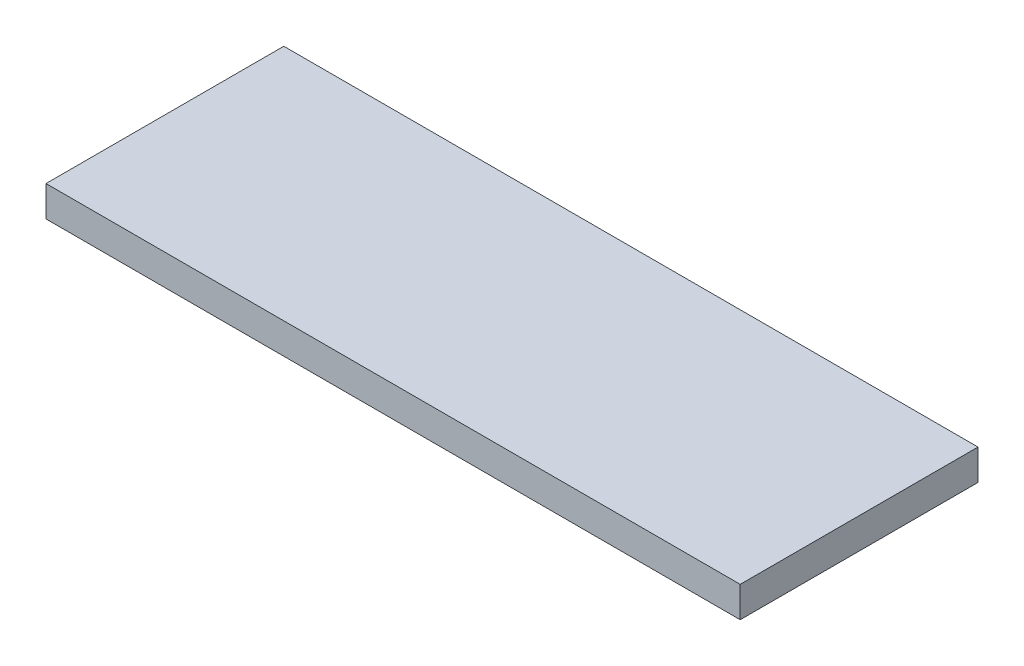
ISO-10303-21;
HEADER;
FILE_DESCRIPTION(('STEP AP214'),'2;1');
FILE_NAME('part.step','',(''),(''),'','','');
FILE_SCHEMA(('AUTOMOTIVE_DESIGN { 1 0 10303 214 1 1 1 1 }'));
ENDSEC;
DATA;
#1=APPLICATION_CONTEXT('core data for automotive mechanical design processes');
#2=APPLICATION_PROTOCOL_DEFINITION('international standard','automotive_design',2000,#1);
#3=PRODUCT_CONTEXT('',#1,'mechanical');
#4=PRODUCT('Part','Part','',(#3));
#5=PRODUCT_RELATED_PRODUCT_CATEGORY('part','',(#4));
#6=PRODUCT_DEFINITION_FORMATION('','',#4);
#7=PRODUCT_DEFINITION_CONTEXT('part definition',#1,'design');
#8=PRODUCT_DEFINITION('design','',#6,#7);
#9=PRODUCT_DEFINITION_SHAPE('','',#8);
#10=(LENGTH_UNIT() NAMED_UNIT(*) SI_UNIT(.MILLI.,.METRE.));
#11=(NAMED_UNIT(*) PLANE_ANGLE_UNIT() SI_UNIT($,.RADIAN.));
#12=(NAMED_UNIT(*) SI_UNIT($,.STERADIAN.) SOLID_ANGLE_UNIT());
#13=UNCERTAINTY_MEASURE_WITH_UNIT(LENGTH_MEASURE(1.E-05),#10,'distance_accuracy_value','');
#14=(GEOMETRIC_REPRESENTATION_CONTEXT(3) GLOBAL_UNCERTAINTY_ASSIGNED_CONTEXT((#13)) GLOBAL_UNIT_ASSIGNED_CONTEXT((#10,
#11,#12)) REPRESENTATION_CONTEXT('',''));
#15=CARTESIAN_POINT('',(0.,0.,0.));
#16=DIRECTION('',(0.,0.,1.));
#17=DIRECTION('',(1.,0.,0.));
#18=AXIS2_PLACEMENT_3D('',#15,#16,#17);
#19=CARTESIAN_POINT('',(0.,8.00000000000001,0.));
#20=DIRECTION('',(0.,1.,0.));
#21=DIRECTION('',(0.,0.,1.));
#22=AXIS2_PLACEMENT_3D('',#19,#20,#21);
#23=PLANE('',#22);
#24=DIRECTION('',(-1.,0.,0.));
#25=VECTOR('',#24,1.);
#26=CARTESIAN_POINT('',(90.5,8.00000000000001,-31.));
#27=LINE('',#26,#25);
#28=CARTESIAN_POINT('',(-90.5,8.00000000000001,-31.));
#29=VERTEX_POINT('',#28);
#30=CARTESIAN_POINT('',(90.5,8.00000000000001,-31.));
#31=VERTEX_POINT('',#30);
#32=EDGE_CURVE('E67',#29,#31,#27,.F.);
#33=ORIENTED_EDGE('',*,*,#32,.F.);
#34=DIRECTION('',(0.,0.,1.));
#35=VECTOR('',#34,1.);
#36=CARTESIAN_POINT('',(-90.5,8.00000000000001,-31.));
#37=LINE('',#36,#35);
#38=CARTESIAN_POINT('',(-90.5,8.00000000000001,31.));
#39=VERTEX_POINT('',#38);
#40=EDGE_CURVE('E19',#39,#29,#37,.F.);
#41=ORIENTED_EDGE('',*,*,#40,.F.);
#42=DIRECTION('',(1.,0.,0.));
#43=VECTOR('',#42,1.);
#44=CARTESIAN_POINT('',(-90.5,8.00000000000001,31.));
#45=LINE('',#44,#43);
#46=CARTESIAN_POINT('',(90.5,8.00000000000001,31.));
#47=VERTEX_POINT('',#46);
#48=EDGE_CURVE('E57',#47,#39,#45,.F.);
#49=ORIENTED_EDGE('',*,*,#48,.F.);
#50=DIRECTION('',(0.,0.,-1.));
#51=VECTOR('',#50,1.);
#52=CARTESIAN_POINT('',(90.5,8.00000000000001,31.));
#53=LINE('',#52,#51);
#54=EDGE_CURVE('E52',#31,#47,#53,.F.);
#55=ORIENTED_EDGE('',*,*,#54,.F.);
#56=EDGE_LOOP('',(#33,#41,#49,#55));
#57=FACE_BOUND('',#56,.T.);
#58=ADVANCED_FACE('F16',(#57),#23,.T.);
#59=CARTESIAN_POINT('',(-90.5,0.,-31.));
#60=DIRECTION('',(-1.,0.,0.));
#61=DIRECTION('',(0.,0.,1.));
#62=AXIS2_PLACEMENT_3D('',#59,#60,#61);
#63=PLANE('',#62);
#64=DIRECTION('',(0.,1.,0.));
#65=VECTOR('',#64,1.);
#66=CARTESIAN_POINT('',(-90.5,0.,-31.));
#67=LINE('',#66,#65);
#68=CARTESIAN_POINT('',(-90.5,0.,-31.));
#69=VERTEX_POINT('',#68);
#70=EDGE_CURVE('E78',#69,#29,#67,.T.);
#71=ORIENTED_EDGE('',*,*,#70,.F.);
#72=DIRECTION('',(0.,0.,1.));
#73=VECTOR('',#72,1.);
#74=CARTESIAN_POINT('',(-90.5,0.,0.));
#75=LINE('',#74,#73);
#76=CARTESIAN_POINT('',(-90.5,0.,31.));
#77=VERTEX_POINT('',#76);
#78=EDGE_CURVE('E73',#69,#77,#75,.T.);
#79=ORIENTED_EDGE('',*,*,#78,.T.);
#80=DIRECTION('',(0.,1.,0.));
#81=VECTOR('',#80,1.);
#82=CARTESIAN_POINT('',(-90.5,0.,31.));
#83=LINE('',#82,#81);
#84=EDGE_CURVE('E62',#39,#77,#83,.F.);
#85=ORIENTED_EDGE('',*,*,#84,.F.);
#86=ORIENTED_EDGE('',*,*,#40,.T.);
#87=EDGE_LOOP('',(#71,#79,#85,#86));
#88=FACE_BOUND('',#87,.T.);
#89=ADVANCED_FACE('F72',(#88),#63,.T.);
#90=CARTESIAN_POINT('',(-90.5,0.,31.));
#91=DIRECTION('',(0.,0.,1.));
#92=DIRECTION('',(1.,0.,0.));
#93=AXIS2_PLACEMENT_3D('',#90,#91,#92);
#94=PLANE('',#93);
#95=ORIENTED_EDGE('',*,*,#84,.T.);
#96=DIRECTION('',(1.,0.,0.));
#97=VECTOR('',#96,1.);
#98=CARTESIAN_POINT('',(0.,0.,31.));
#99=LINE('',#98,#97);
#100=CARTESIAN_POINT('',(90.5,0.,31.));
#101=VERTEX_POINT('',#100);
#102=EDGE_CURVE('E83',#77,#101,#99,.T.);
#103=ORIENTED_EDGE('',*,*,#102,.T.);
#104=DIRECTION('',(0.,1.,0.));
#105=VECTOR('',#104,1.);
#106=CARTESIAN_POINT('',(90.5,0.,31.));
#107=LINE('',#106,#105);
#108=EDGE_CURVE('E64',#47,#101,#107,.F.);
#109=ORIENTED_EDGE('',*,*,#108,.F.);
#110=ORIENTED_EDGE('',*,*,#48,.T.);
#111=EDGE_LOOP('',(#95,#103,#109,#110));
#112=FACE_BOUND('',#111,.T.);
#113=ADVANCED_FACE('F59',(#112),#94,.T.);
#114=CARTESIAN_POINT('',(90.5,0.,31.));
#115=DIRECTION('',(1.,0.,0.));
#116=DIRECTION('',(0.,0.,-1.));
#117=AXIS2_PLACEMENT_3D('',#114,#115,#116);
#118=PLANE('',#117);
#119=ORIENTED_EDGE('',*,*,#108,.T.);
#120=DIRECTION('',(0.,0.,1.));
#121=VECTOR('',#120,1.);
#122=CARTESIAN_POINT('',(90.5,0.,0.));
#123=LINE('',#122,#121);
#124=CARTESIAN_POINT('',(90.5,0.,-31.));
#125=VERTEX_POINT('',#124);
#126=EDGE_CURVE('E25',#101,#125,#123,.F.);
#127=ORIENTED_EDGE('',*,*,#126,.T.);
#128=DIRECTION('',(0.,1.,0.));
#129=VECTOR('',#128,1.);
#130=CARTESIAN_POINT('',(90.5,0.,-31.));
#131=LINE('',#130,#129);
#132=EDGE_CURVE('E33',#31,#125,#131,.F.);
#133=ORIENTED_EDGE('',*,*,#132,.F.);
#134=ORIENTED_EDGE('',*,*,#54,.T.);
#135=EDGE_LOOP('',(#119,#127,#133,#134));
#136=FACE_BOUND('',#135,.T.);
#137=ADVANCED_FACE('F87',(#136),#118,.T.);
#138=CARTESIAN_POINT('',(90.5,0.,-31.));
#139=DIRECTION('',(0.,0.,-1.));
#140=DIRECTION('',(-1.,0.,0.));
#141=AXIS2_PLACEMENT_3D('',#138,#139,#140);
#142=PLANE('',#141);
#143=ORIENTED_EDGE('',*,*,#132,.T.);
#144=DIRECTION('',(1.,0.,0.));
#145=VECTOR('',#144,1.);
#146=CARTESIAN_POINT('',(0.,0.,-31.));
#147=LINE('',#146,#145);
#148=EDGE_CURVE('E11',#125,#69,#147,.F.);
#149=ORIENTED_EDGE('',*,*,#148,.T.);
#150=ORIENTED_EDGE('',*,*,#70,.T.);
#151=ORIENTED_EDGE('',*,*,#32,.T.);
#152=EDGE_LOOP('',(#143,#149,#150,#151));
#153=FACE_BOUND('',#152,.T.);
#154=ADVANCED_FACE('F90',(#153),#142,.T.);
#155=CARTESIAN_POINT('',(0.,0.,0.));
#156=DIRECTION('',(0.,1.,0.));
#157=DIRECTION('',(0.,0.,1.));
#158=AXIS2_PLACEMENT_3D('',#155,#156,#157);
#159=PLANE('',#158);
#160=ORIENTED_EDGE('',*,*,#126,.F.);
#161=ORIENTED_EDGE('',*,*,#102,.F.);
#162=ORIENTED_EDGE('',*,*,#78,.F.);
#163=ORIENTED_EDGE('',*,*,#148,.F.);
#164=EDGE_LOOP('',(#160,#161,#162,#163));
#165=FACE_BOUND('',#164,.T.);
#166=ADVANCED_FACE('F89',(#165),#159,.F.);
#167=CLOSED_SHELL('',(#58,#89,#113,#137,#154,#166));
#168=MANIFOLD_SOLID_BREP('B1',#167);
#169=ADVANCED_BREP_SHAPE_REPRESENTATION('',(#18,#168),#14);
#170=SHAPE_DEFINITION_REPRESENTATION(#9,#169);
ENDSEC;
END-ISO-10303-21;
